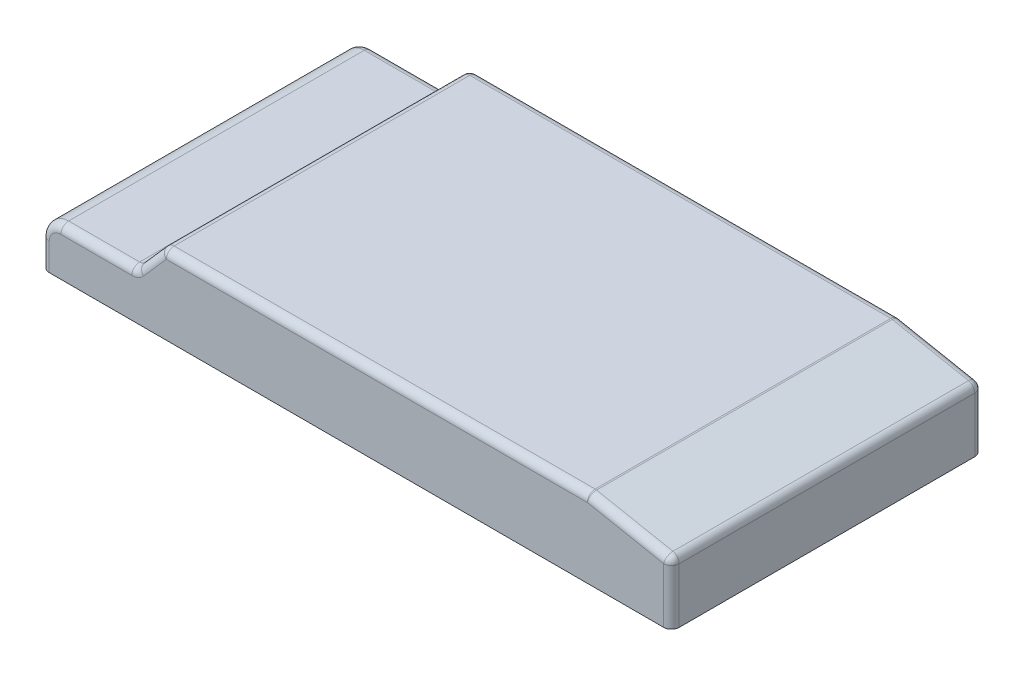
ISO-10303-21;
HEADER;
FILE_DESCRIPTION(('STEP AP214'),'2;1');
FILE_NAME('part.step','',(''),(''),'','','');
FILE_SCHEMA(('AUTOMOTIVE_DESIGN { 1 0 10303 214 1 1 1 1 }'));
ENDSEC;
DATA;
#1=APPLICATION_CONTEXT('core data for automotive mechanical design processes');
#2=APPLICATION_PROTOCOL_DEFINITION('international standard','automotive_design',2000,#1);
#3=PRODUCT_CONTEXT('',#1,'mechanical');
#4=PRODUCT('Part','Part','',(#3));
#5=PRODUCT_RELATED_PRODUCT_CATEGORY('part','',(#4));
#6=PRODUCT_DEFINITION_FORMATION('','',#4);
#7=PRODUCT_DEFINITION_CONTEXT('part definition',#1,'design');
#8=PRODUCT_DEFINITION('design','',#6,#7);
#9=PRODUCT_DEFINITION_SHAPE('','',#8);
#10=(LENGTH_UNIT() NAMED_UNIT(*) SI_UNIT(.MILLI.,.METRE.));
#11=(NAMED_UNIT(*) PLANE_ANGLE_UNIT() SI_UNIT($,.RADIAN.));
#12=(NAMED_UNIT(*) SI_UNIT($,.STERADIAN.) SOLID_ANGLE_UNIT());
#13=UNCERTAINTY_MEASURE_WITH_UNIT(LENGTH_MEASURE(1.E-05),#10,'distance_accuracy_value','');
#14=(GEOMETRIC_REPRESENTATION_CONTEXT(3) GLOBAL_UNCERTAINTY_ASSIGNED_CONTEXT((#13)) GLOBAL_UNIT_ASSIGNED_CONTEXT((#10,
#11,#12)) REPRESENTATION_CONTEXT('',''));
#15=CARTESIAN_POINT('',(0.,0.,0.));
#16=DIRECTION('',(0.,0.,1.));
#17=DIRECTION('',(1.,0.,0.));
#18=AXIS2_PLACEMENT_3D('',#15,#16,#17);
#19=CARTESIAN_POINT('',(0.,-4.59991124991438,101.6));
#20=DIRECTION('',(0.,1.,0.));
#21=DIRECTION('',(0.,0.,1.));
#22=AXIS2_PLACEMENT_3D('',#19,#20,#21);
#23=PLANE('',#22);
#24=DIRECTION('',(0.,0.,-1.));
#25=VECTOR('',#24,1.);
#26=CARTESIAN_POINT('',(-58.1812104530821,-4.59991124991438,101.6));
#27=LINE('',#26,#25);
#28=CARTESIAN_POINT('',(-58.1812104530821,-4.59991124991438,99.06));
#29=VERTEX_POINT('',#28);
#30=CARTESIAN_POINT('',(-58.1812104530821,-4.59991124991438,2.54));
#31=VERTEX_POINT('',#30);
#32=EDGE_CURVE('E526',#29,#31,#27,.T.);
#33=ORIENTED_EDGE('',*,*,#32,.T.);
#34=CARTESIAN_POINT('',(-55.6412104530821,-4.59991124991438,2.54));
#35=DIRECTION('',(0.,1.,0.));
#36=DIRECTION('',(0.,0.,1.));
#37=AXIS2_PLACEMENT_3D('',#34,#35,#36);
#38=CIRCLE('',#37,2.54);
#39=CARTESIAN_POINT('',(-55.6412104530821,-4.59991124991438,0.));
#40=VERTEX_POINT('',#39);
#41=EDGE_CURVE('E589',#31,#40,#38,.F.);
#42=ORIENTED_EDGE('',*,*,#41,.T.);
#43=DIRECTION('',(1.,0.,0.));
#44=VECTOR('',#43,1.);
#45=CARTESIAN_POINT('',(0.,-4.59991124991438,0.));
#46=LINE('',#45,#44);
#47=CARTESIAN_POINT('',(145.018789546918,-4.59991124991438,0.));
#48=VERTEX_POINT('',#47);
#49=EDGE_CURVE('E521',#40,#48,#46,.T.);
#50=ORIENTED_EDGE('',*,*,#49,.T.);
#51=CARTESIAN_POINT('',(145.018789546918,-4.59991124991438,2.54));
#52=DIRECTION('',(0.,1.,0.));
#53=DIRECTION('',(0.,0.,1.));
#54=AXIS2_PLACEMENT_3D('',#51,#52,#53);
#55=CIRCLE('',#54,2.54);
#56=CARTESIAN_POINT('',(147.558789546918,-4.59991124991438,2.54));
#57=VERTEX_POINT('',#56);
#58=EDGE_CURVE('E586',#48,#57,#55,.F.);
#59=ORIENTED_EDGE('',*,*,#58,.T.);
#60=DIRECTION('',(0.,0.,-1.));
#61=VECTOR('',#60,1.);
#62=CARTESIAN_POINT('',(147.558789546918,-4.59991124991438,101.6));
#63=LINE('',#62,#61);
#64=CARTESIAN_POINT('',(147.558789546918,-4.59991124991438,99.06));
#65=VERTEX_POINT('',#64);
#66=EDGE_CURVE('E520',#65,#57,#63,.T.);
#67=ORIENTED_EDGE('',*,*,#66,.F.);
#68=CARTESIAN_POINT('',(145.018789546918,-4.59991124991438,99.06));
#69=DIRECTION('',(0.,1.,0.));
#70=DIRECTION('',(0.,0.,1.));
#71=AXIS2_PLACEMENT_3D('',#68,#69,#70);
#72=CIRCLE('',#71,2.54);
#73=CARTESIAN_POINT('',(145.018789546918,-4.59991124991438,101.6));
#74=VERTEX_POINT('',#73);
#75=EDGE_CURVE('E580',#65,#74,#72,.F.);
#76=ORIENTED_EDGE('',*,*,#75,.T.);
#77=DIRECTION('',(1.,0.,0.));
#78=VECTOR('',#77,1.);
#79=CARTESIAN_POINT('',(0.,-4.59991124991438,101.6));
#80=LINE('',#79,#78);
#81=CARTESIAN_POINT('',(-55.6412104530821,-4.59991124991438,101.6));
#82=VERTEX_POINT('',#81);
#83=EDGE_CURVE('E516',#82,#74,#80,.T.);
#84=ORIENTED_EDGE('',*,*,#83,.F.);
#85=CARTESIAN_POINT('',(-55.6412104530821,-4.59991124991438,99.06));
#86=DIRECTION('',(0.,1.,0.));
#87=DIRECTION('',(0.,0.,1.));
#88=AXIS2_PLACEMENT_3D('',#85,#86,#87);
#89=CIRCLE('',#88,2.54);
#90=EDGE_CURVE('E583',#82,#29,#89,.F.);
#91=ORIENTED_EDGE('',*,*,#90,.T.);
#92=EDGE_LOOP('',(#33,#42,#50,#59,#67,#76,#84,#91));
#93=FACE_BOUND('',#92,.T.);
#94=DIRECTION('',(-1.,0.,0.));
#95=VECTOR('',#94,1.);
#96=CARTESIAN_POINT('',(0.,-4.59991124991438,6.35));
#97=LINE('',#96,#95);
#98=CARTESIAN_POINT('',(119.935660247496,-4.59991124991438,6.34999999999999));
#99=VERTEX_POINT('',#98);
#100=CARTESIAN_POINT('',(-17.1500030519735,-4.59991124991438,6.35));
#101=VERTEX_POINT('',#100);
#102=EDGE_CURVE('E313',#99,#101,#97,.T.);
#103=ORIENTED_EDGE('',*,*,#102,.T.);
#104=DIRECTION('',(0.,0.,-1.));
#105=VECTOR('',#104,1.);
#106=CARTESIAN_POINT('',(-17.1500030519735,-4.59991124991438,0.));
#107=LINE('',#106,#105);
#108=CARTESIAN_POINT('',(-17.1500030519735,-4.59991124991438,95.25));
#109=VERTEX_POINT('',#108);
#110=EDGE_CURVE('E488',#109,#101,#107,.T.);
#111=ORIENTED_EDGE('',*,*,#110,.F.);
#112=DIRECTION('',(1.,0.,0.));
#113=VECTOR('',#112,1.);
#114=CARTESIAN_POINT('',(0.,-4.59991124991438,95.25));
#115=LINE('',#114,#113);
#116=CARTESIAN_POINT('',(119.935660247496,-4.59991124991438,95.25));
#117=VERTEX_POINT('',#116);
#118=EDGE_CURVE('E492',#109,#117,#115,.T.);
#119=ORIENTED_EDGE('',*,*,#118,.T.);
#120=DIRECTION('',(0.,0.,-1.));
#121=VECTOR('',#120,1.);
#122=CARTESIAN_POINT('',(119.935660247496,-4.59991124991438,0.));
#123=LINE('',#122,#121);
#124=EDGE_CURVE('E501',#117,#99,#123,.T.);
#125=ORIENTED_EDGE('',*,*,#124,.T.);
#126=EDGE_LOOP('',(#103,#111,#119,#125));
#127=FACE_BOUND('',#126,.T.);
#128=ADVANCED_FACE('F295',(#93,#127),#23,.F.);
#129=CARTESIAN_POINT('',(0.,0.,0.));
#130=DIRECTION('',(0.,0.,1.));
#131=DIRECTION('',(1.,0.,0.));
#132=AXIS2_PLACEMENT_3D('',#129,#130,#131);
#133=PLANE('',#132);
#134=ORIENTED_EDGE('',*,*,#49,.F.);
#135=DIRECTION('',(0.,-1.,0.));
#136=VECTOR('',#135,1.);
#137=CARTESIAN_POINT('',(-55.6412104530821,0.,0.));
#138=LINE('',#137,#136);
#139=CARTESIAN_POINT('',(-55.6412104530821,4.29008875008562,0.));
#140=VERTEX_POINT('',#139);
#141=EDGE_CURVE('E613',#40,#140,#138,.F.);
#142=ORIENTED_EDGE('',*,*,#141,.T.);
#143=CARTESIAN_POINT('',(-51.8312104530821,4.29008875008562,0.));
#144=DIRECTION('',(0.,0.,1.));
#145=DIRECTION('',(1.,0.,0.));
#146=AXIS2_PLACEMENT_3D('',#143,#144,#145);
#147=CIRCLE('',#146,3.81);
#148=CARTESIAN_POINT('',(-51.8312104530821,8.10008875008561,0.));
#149=VERTEX_POINT('',#148);
#150=EDGE_CURVE('E610',#140,#149,#147,.F.);
#151=ORIENTED_EDGE('',*,*,#150,.T.);
#152=DIRECTION('',(1.,0.,0.));
#153=VECTOR('',#152,1.);
#154=CARTESIAN_POINT('',(-28.6539553864499,8.10008875008561,0.));
#155=LINE('',#154,#153);
#156=CARTESIAN_POINT('',(-28.6539553864499,8.10008875008561,0.));
#157=VERTEX_POINT('',#156);
#158=EDGE_CURVE('E607',#149,#157,#155,.T.);
#159=ORIENTED_EDGE('',*,*,#158,.T.);
#160=CARTESIAN_POINT('',(-28.6539553864499,13.1800887500856,0.));
#161=DIRECTION('',(0.,0.,1.));
#162=DIRECTION('',(1.,0.,0.));
#163=AXIS2_PLACEMENT_3D('',#160,#161,#162);
#164=CIRCLE('',#163,5.08);
#165=CARTESIAN_POINT('',(-24.8474004980594,9.81608222784605,0.));
#166=VERTEX_POINT('',#165);
#167=EDGE_CURVE('E604',#157,#166,#164,.T.);
#168=ORIENTED_EDGE('',*,*,#167,.T.);
#169=DIRECTION('',(0.662206008314876,0.749321828423328,0.));
#170=VECTOR('',#169,1.);
#171=CARTESIAN_POINT('',(-17.3850903915426,18.2600887500856,0.));
#172=LINE('',#171,#170);
#173=CARTESIAN_POINT('',(-17.3850903915426,18.2600887500856,0.));
#174=VERTEX_POINT('',#173);
#175=EDGE_CURVE('E601',#166,#174,#172,.T.);
#176=ORIENTED_EDGE('',*,*,#175,.T.);
#177=DIRECTION('',(1.,0.,0.));
#178=VECTOR('',#177,1.);
#179=CARTESIAN_POINT('',(120.105733974677,18.2600887500856,0.));
#180=LINE('',#179,#178);
#181=CARTESIAN_POINT('',(120.105733974677,18.2600887500856,0.));
#182=VERTEX_POINT('',#181);
#183=EDGE_CURVE('E592',#174,#182,#180,.T.);
#184=ORIENTED_EDGE('',*,*,#183,.T.);
#185=DIRECTION('',(0.981525700668784,-0.191330339796521,0.));
#186=VECTOR('',#185,1.);
#187=CARTESIAN_POINT('',(145.018789546918,13.4037478669496,0.));
#188=LINE('',#187,#186);
#189=CARTESIAN_POINT('',(145.018789546918,13.4037478669496,0.));
#190=VERTEX_POINT('',#189);
#191=EDGE_CURVE('E595',#182,#190,#188,.T.);
#192=ORIENTED_EDGE('',*,*,#191,.T.);
#193=DIRECTION('',(0.,-1.,0.));
#194=VECTOR('',#193,1.);
#195=CARTESIAN_POINT('',(145.018789546918,-4.59991124991438,0.));
#196=LINE('',#195,#194);
#197=EDGE_CURVE('E598',#190,#48,#196,.T.);
#198=ORIENTED_EDGE('',*,*,#197,.T.);
#199=EDGE_LOOP('',(#134,#142,#151,#159,#168,#176,#184,#192,#198));
#200=FACE_BOUND('',#199,.T.);
#201=ADVANCED_FACE('F853',(#200),#133,.F.);
#202=CARTESIAN_POINT('',(8.31189072919763,42.6400453819004,101.6));
#203=DIRECTION('',(0.191330339796521,0.981525700668784,0.));
#204=DIRECTION('',(-0.981525700668784,0.191330339796521,0.));
#205=AXIS2_PLACEMENT_3D('',#202,#203,#204);
#206=PLANE('',#205);
#207=DIRECTION('',(0.,0.,-1.));
#208=VECTOR('',#207,1.);
#209=CARTESIAN_POINT('',(145.504768610001,15.8968231466484,101.6));
#210=LINE('',#209,#208);
#211=CARTESIAN_POINT('',(145.504768610001,15.8968231466484,99.06));
#212=VERTEX_POINT('',#211);
#213=CARTESIAN_POINT('',(145.504768610001,15.8968231466484,2.54));
#214=VERTEX_POINT('',#213);
#215=EDGE_CURVE('E541',#212,#214,#210,.T.);
#216=ORIENTED_EDGE('',*,*,#215,.T.);
#217=DIRECTION('',(0.981525700668784,-0.191330339796521,0.));
#218=VECTOR('',#217,1.);
#219=CARTESIAN_POINT('',(120.59171303776,20.7531640297843,2.54));
#220=LINE('',#219,#218);
#221=CARTESIAN_POINT('',(120.59171303776,20.7531640297843,2.54));
#222=VERTEX_POINT('',#221);
#223=EDGE_CURVE('E661',#214,#222,#220,.F.);
#224=ORIENTED_EDGE('',*,*,#223,.T.);
#225=DIRECTION('',(0.,0.,-1.));
#226=VECTOR('',#225,1.);
#227=CARTESIAN_POINT('',(120.59171303776,20.7531640297843,101.6));
#228=LINE('',#227,#226);
#229=CARTESIAN_POINT('',(120.59171303776,20.7531640297843,99.06));
#230=VERTEX_POINT('',#229);
#231=EDGE_CURVE('E561',#222,#230,#228,.F.);
#232=ORIENTED_EDGE('',*,*,#231,.T.);
#233=DIRECTION('',(0.981525700668784,-0.191330339796521,0.));
#234=VECTOR('',#233,1.);
#235=CARTESIAN_POINT('',(8.31189072919763,42.6400453819004,99.06));
#236=LINE('',#235,#234);
#237=EDGE_CURVE('E658',#230,#212,#236,.T.);
#238=ORIENTED_EDGE('',*,*,#237,.T.);
#239=EDGE_LOOP('',(#216,#224,#232,#238));
#240=FACE_BOUND('',#239,.T.);
#241=ADVANCED_FACE('F801',(#240),#206,.T.);
#242=CARTESIAN_POINT('',(0.,20.8000887500856,101.6));
#243=DIRECTION('',(0.,1.,0.));
#244=DIRECTION('',(0.,0.,1.));
#245=AXIS2_PLACEMENT_3D('',#242,#243,#244);
#246=PLANE('',#245);
#247=DIRECTION('',(0.,0.,-1.));
#248=VECTOR('',#247,1.);
#249=CARTESIAN_POINT('',(120.105733974677,20.8000887500856,101.6));
#250=LINE('',#249,#248);
#251=CARTESIAN_POINT('',(120.105733974677,20.8000887500856,99.06));
#252=VERTEX_POINT('',#251);
#253=CARTESIAN_POINT('',(120.105733974677,20.8000887500856,2.54));
#254=VERTEX_POINT('',#253);
#255=EDGE_CURVE('E553',#252,#254,#250,.T.);
#256=ORIENTED_EDGE('',*,*,#255,.T.);
#257=DIRECTION('',(1.,0.,0.));
#258=VECTOR('',#257,1.);
#259=CARTESIAN_POINT('',(-17.3850903915426,20.8000887500856,2.54));
#260=LINE('',#259,#258);
#261=CARTESIAN_POINT('',(-17.3850903915426,20.8000887500856,2.54));
#262=VERTEX_POINT('',#261);
#263=EDGE_CURVE('E12',#254,#262,#260,.F.);
#264=ORIENTED_EDGE('',*,*,#263,.T.);
#265=DIRECTION('',(0.,0.,-1.));
#266=VECTOR('',#265,1.);
#267=CARTESIAN_POINT('',(-17.3850903915426,20.8000887500856,101.6));
#268=LINE('',#267,#266);
#269=CARTESIAN_POINT('',(-17.3850903915426,20.8000887500856,99.06));
#270=VERTEX_POINT('',#269);
#271=EDGE_CURVE('E557',#262,#270,#268,.F.);
#272=ORIENTED_EDGE('',*,*,#271,.T.);
#273=DIRECTION('',(1.,0.,0.));
#274=VECTOR('',#273,1.);
#275=CARTESIAN_POINT('',(0.,20.8000887500856,99.06));
#276=LINE('',#275,#274);
#277=EDGE_CURVE('E305',#270,#252,#276,.T.);
#278=ORIENTED_EDGE('',*,*,#277,.T.);
#279=EDGE_LOOP('',(#256,#264,#272,#278));
#280=FACE_BOUND('',#279,.T.);
#281=ADVANCED_FACE('F820',(#280),#246,.T.);
#282=CARTESIAN_POINT('',(-20.725468625549,18.3159349272638,101.6));
#283=DIRECTION('',(-0.749321828423328,0.662206008314876,0.));
#284=DIRECTION('',(-0.662206008314876,-0.749321828423328,0.));
#285=AXIS2_PLACEMENT_3D('',#282,#283,#284);
#286=PLANE('',#285);
#287=DIRECTION('',(0.,0.,-1.));
#288=VECTOR('',#287,1.);
#289=CARTESIAN_POINT('',(-19.2883678357379,19.9420920112054,101.6));
#290=LINE('',#289,#288);
#291=CARTESIAN_POINT('',(-19.2883678357379,19.9420920112054,99.06));
#292=VERTEX_POINT('',#291);
#293=CARTESIAN_POINT('',(-19.2883678357379,19.9420920112054,2.54));
#294=VERTEX_POINT('',#293);
#295=EDGE_CURVE('E549',#292,#294,#290,.T.);
#296=ORIENTED_EDGE('',*,*,#295,.T.);
#297=DIRECTION('',(0.662206008314876,0.749321828423328,0.));
#298=VECTOR('',#297,1.);
#299=CARTESIAN_POINT('',(-26.7506779422547,11.4980854889658,2.54));
#300=LINE('',#299,#298);
#301=CARTESIAN_POINT('',(-26.7506779422547,11.4980854889658,2.54));
#302=VERTEX_POINT('',#301);
#303=EDGE_CURVE('E637',#294,#302,#300,.F.);
#304=ORIENTED_EDGE('',*,*,#303,.T.);
#305=DIRECTION('',(0.,0.,-1.));
#306=VECTOR('',#305,1.);
#307=CARTESIAN_POINT('',(-26.7506779422547,11.4980854889658,101.6));
#308=LINE('',#307,#306);
#309=CARTESIAN_POINT('',(-26.7506779422547,11.4980854889658,99.06));
#310=VERTEX_POINT('',#309);
#311=EDGE_CURVE('E569',#302,#310,#308,.F.);
#312=ORIENTED_EDGE('',*,*,#311,.T.);
#313=DIRECTION('',(0.662206008314876,0.749321828423328,0.));
#314=VECTOR('',#313,1.);
#315=CARTESIAN_POINT('',(-20.725468625549,18.3159349272638,99.06));
#316=LINE('',#315,#314);
#317=EDGE_CURVE('E634',#310,#292,#316,.T.);
#318=ORIENTED_EDGE('',*,*,#317,.T.);
#319=EDGE_LOOP('',(#296,#304,#312,#318));
#320=FACE_BOUND('',#319,.T.);
#321=ADVANCED_FACE('F879',(#320),#286,.T.);
#322=CARTESIAN_POINT('',(0.,10.6400887500856,101.6));
#323=DIRECTION('',(0.,1.,0.));
#324=DIRECTION('',(0.,0.,1.));
#325=AXIS2_PLACEMENT_3D('',#322,#323,#324);
#326=PLANE('',#325);
#327=DIRECTION('',(0.,0.,-1.));
#328=VECTOR('',#327,1.);
#329=CARTESIAN_POINT('',(-28.6539553864499,10.6400887500856,0.));
#330=LINE('',#329,#328);
#331=CARTESIAN_POINT('',(-28.6539553864499,10.6400887500856,99.06));
#332=VERTEX_POINT('',#331);
#333=CARTESIAN_POINT('',(-28.6539553864499,10.6400887500856,2.54));
#334=VERTEX_POINT('',#333);
#335=EDGE_CURVE('E565',#332,#334,#330,.T.);
#336=ORIENTED_EDGE('',*,*,#335,.T.);
#337=DIRECTION('',(1.,0.,0.));
#338=VECTOR('',#337,1.);
#339=CARTESIAN_POINT('',(-51.8312104530821,10.6400887500856,2.54));
#340=LINE('',#339,#338);
#341=CARTESIAN_POINT('',(-51.8312104530821,10.6400887500856,2.54));
#342=VERTEX_POINT('',#341);
#343=EDGE_CURVE('E625',#334,#342,#340,.F.);
#344=ORIENTED_EDGE('',*,*,#343,.T.);
#345=DIRECTION('',(0.,0.,-1.));
#346=VECTOR('',#345,1.);
#347=CARTESIAN_POINT('',(-51.8312104530821,10.6400887500856,101.6));
#348=LINE('',#347,#346);
#349=CARTESIAN_POINT('',(-51.8312104530821,10.6400887500856,99.06));
#350=VERTEX_POINT('',#349);
#351=EDGE_CURVE('E537',#342,#350,#348,.F.);
#352=ORIENTED_EDGE('',*,*,#351,.T.);
#353=DIRECTION('',(1.,0.,0.));
#354=VECTOR('',#353,1.);
#355=CARTESIAN_POINT('',(0.,10.6400887500856,99.06));
#356=LINE('',#355,#354);
#357=EDGE_CURVE('E622',#350,#332,#356,.T.);
#358=ORIENTED_EDGE('',*,*,#357,.T.);
#359=EDGE_LOOP('',(#336,#344,#352,#358));
#360=FACE_BOUND('',#359,.T.);
#361=ADVANCED_FACE('F882',(#360),#326,.T.);
#362=CARTESIAN_POINT('',(-58.1812104530821,0.,101.6));
#363=DIRECTION('',(1.,0.,0.));
#364=DIRECTION('',(0.,0.,-1.));
#365=AXIS2_PLACEMENT_3D('',#362,#363,#364);
#366=PLANE('',#365);
#367=DIRECTION('',(0.,0.,-1.));
#368=VECTOR('',#367,1.);
#369=CARTESIAN_POINT('',(-58.1812104530821,4.29008875008562,0.));
#370=LINE('',#369,#368);
#371=CARTESIAN_POINT('',(-58.1812104530821,4.29008875008562,99.06));
#372=VERTEX_POINT('',#371);
#373=CARTESIAN_POINT('',(-58.1812104530821,4.29008875008562,2.54));
#374=VERTEX_POINT('',#373);
#375=EDGE_CURVE('E530',#372,#374,#370,.T.);
#376=ORIENTED_EDGE('',*,*,#375,.T.);
#377=DIRECTION('',(0.,-1.,0.));
#378=VECTOR('',#377,1.);
#379=CARTESIAN_POINT('',(-58.1812104530821,0.,2.54));
#380=LINE('',#379,#378);
#381=EDGE_CURVE('E576',#374,#31,#380,.T.);
#382=ORIENTED_EDGE('',*,*,#381,.T.);
#383=ORIENTED_EDGE('',*,*,#32,.F.);
#384=DIRECTION('',(0.,-1.,0.));
#385=VECTOR('',#384,1.);
#386=CARTESIAN_POINT('',(-58.1812104530821,4.29008875008562,99.06));
#387=LINE('',#386,#385);
#388=EDGE_CURVE('E573',#29,#372,#387,.F.);
#389=ORIENTED_EDGE('',*,*,#388,.T.);
#390=EDGE_LOOP('',(#376,#382,#383,#389));
#391=FACE_BOUND('',#390,.T.);
#392=ADVANCED_FACE('F871',(#391),#366,.F.);
#393=CARTESIAN_POINT('',(147.558789546918,0.,101.6));
#394=DIRECTION('',(1.,0.,0.));
#395=DIRECTION('',(0.,0.,-1.));
#396=AXIS2_PLACEMENT_3D('',#393,#394,#395);
#397=PLANE('',#396);
#398=ORIENTED_EDGE('',*,*,#66,.T.);
#399=DIRECTION('',(0.,-1.,0.));
#400=VECTOR('',#399,1.);
#401=CARTESIAN_POINT('',(147.558789546918,13.4037478669496,2.54));
#402=LINE('',#401,#400);
#403=CARTESIAN_POINT('',(147.558789546918,13.4037478669496,2.54));
#404=VERTEX_POINT('',#403);
#405=EDGE_CURVE('E649',#57,#404,#402,.F.);
#406=ORIENTED_EDGE('',*,*,#405,.T.);
#407=DIRECTION('',(0.,0.,-1.));
#408=VECTOR('',#407,1.);
#409=CARTESIAN_POINT('',(147.558789546918,13.4037478669496,101.6));
#410=LINE('',#409,#408);
#411=CARTESIAN_POINT('',(147.558789546918,13.4037478669496,99.06));
#412=VERTEX_POINT('',#411);
#413=EDGE_CURVE('E545',#404,#412,#410,.F.);
#414=ORIENTED_EDGE('',*,*,#413,.T.);
#415=DIRECTION('',(0.,-1.,0.));
#416=VECTOR('',#415,1.);
#417=CARTESIAN_POINT('',(147.558789546918,0.,99.06));
#418=LINE('',#417,#416);
#419=EDGE_CURVE('E646',#412,#65,#418,.T.);
#420=ORIENTED_EDGE('',*,*,#419,.T.);
#421=EDGE_LOOP('',(#398,#406,#414,#420));
#422=FACE_BOUND('',#421,.T.);
#423=ADVANCED_FACE('F783',(#422),#397,.T.);
#424=CARTESIAN_POINT('',(0.,0.,101.6));
#425=DIRECTION('',(0.,0.,1.));
#426=DIRECTION('',(1.,0.,0.));
#427=AXIS2_PLACEMENT_3D('',#424,#425,#426);
#428=PLANE('',#427);
#429=CARTESIAN_POINT('',(-51.8312104530821,4.29008875008562,101.6));
#430=DIRECTION('',(0.,0.,1.));
#431=DIRECTION('',(1.,0.,0.));
#432=AXIS2_PLACEMENT_3D('',#429,#430,#431);
#433=CIRCLE('',#432,3.81);
#434=CARTESIAN_POINT('',(-51.8312104530821,8.10008875008561,101.6));
#435=VERTEX_POINT('',#434);
#436=CARTESIAN_POINT('',(-55.6412104530821,4.29008875008562,101.6));
#437=VERTEX_POINT('',#436);
#438=EDGE_CURVE('E321',#435,#437,#433,.T.);
#439=ORIENTED_EDGE('',*,*,#438,.T.);
#440=DIRECTION('',(0.,-1.,0.));
#441=VECTOR('',#440,1.);
#442=CARTESIAN_POINT('',(-55.6412104530821,-4.59991124991438,101.6));
#443=LINE('',#442,#441);
#444=EDGE_CURVE('E690',#437,#82,#443,.T.);
#445=ORIENTED_EDGE('',*,*,#444,.T.);
#446=ORIENTED_EDGE('',*,*,#83,.T.);
#447=DIRECTION('',(0.,-1.,0.));
#448=VECTOR('',#447,1.);
#449=CARTESIAN_POINT('',(145.018789546918,0.,101.6));
#450=LINE('',#449,#448);
#451=CARTESIAN_POINT('',(145.018789546918,13.4037478669496,101.6));
#452=VERTEX_POINT('',#451);
#453=EDGE_CURVE('E676',#74,#452,#450,.F.);
#454=ORIENTED_EDGE('',*,*,#453,.T.);
#455=DIRECTION('',(0.981525700668784,-0.191330339796521,0.));
#456=VECTOR('',#455,1.);
#457=CARTESIAN_POINT('',(7.82591166611447,40.1469701022017,101.6));
#458=LINE('',#457,#456);
#459=CARTESIAN_POINT('',(120.105733974677,18.2600887500856,101.6));
#460=VERTEX_POINT('',#459);
#461=EDGE_CURVE('E673',#452,#460,#458,.F.);
#462=ORIENTED_EDGE('',*,*,#461,.T.);
#463=DIRECTION('',(1.,0.,0.));
#464=VECTOR('',#463,1.);
#465=CARTESIAN_POINT('',(0.,18.2600887500856,101.6));
#466=LINE('',#465,#464);
#467=CARTESIAN_POINT('',(-17.3850903915426,18.2600887500856,101.6));
#468=VERTEX_POINT('',#467);
#469=EDGE_CURVE('E670',#460,#468,#466,.F.);
#470=ORIENTED_EDGE('',*,*,#469,.T.);
#471=DIRECTION('',(0.662206008314876,0.749321828423328,0.));
#472=VECTOR('',#471,1.);
#473=CARTESIAN_POINT('',(-18.8221911813538,16.633931666144,101.6));
#474=LINE('',#473,#472);
#475=CARTESIAN_POINT('',(-24.8474004980594,9.81608222784605,101.6));
#476=VERTEX_POINT('',#475);
#477=EDGE_CURVE('E679',#468,#476,#474,.F.);
#478=ORIENTED_EDGE('',*,*,#477,.T.);
#479=CARTESIAN_POINT('',(-28.6539553864499,13.1800887500856,101.6));
#480=DIRECTION('',(0.,0.,1.));
#481=DIRECTION('',(1.,0.,0.));
#482=AXIS2_PLACEMENT_3D('',#479,#480,#481);
#483=CIRCLE('',#482,5.08);
#484=CARTESIAN_POINT('',(-28.6539553864499,8.10008875008561,101.6));
#485=VERTEX_POINT('',#484);
#486=EDGE_CURVE('E682',#476,#485,#483,.F.);
#487=ORIENTED_EDGE('',*,*,#486,.T.);
#488=DIRECTION('',(1.,0.,0.));
#489=VECTOR('',#488,1.);
#490=CARTESIAN_POINT('',(0.,8.10008875008561,101.6));
#491=LINE('',#490,#489);
#492=EDGE_CURVE('E685',#485,#435,#491,.F.);
#493=ORIENTED_EDGE('',*,*,#492,.T.);
#494=EDGE_LOOP('',(#439,#445,#446,#454,#462,#470,#478,#487,#493));
#495=FACE_BOUND('',#494,.T.);
#496=ADVANCED_FACE('F838',(#495),#428,.T.);
#497=CARTESIAN_POINT('',(-51.8312104530821,4.29008875008562,101.6));
#498=DIRECTION('',(0.,0.,1.));
#499=DIRECTION('',(1.,0.,0.));
#500=AXIS2_PLACEMENT_3D('',#497,#498,#499);
#501=CYLINDRICAL_SURFACE('',#500,6.35);
#502=ORIENTED_EDGE('',*,*,#351,.F.);
#503=CARTESIAN_POINT('',(-51.8312104530821,4.29008875008562,2.54));
#504=DIRECTION('',(0.,0.,1.));
#505=DIRECTION('',(1.,0.,0.));
#506=AXIS2_PLACEMENT_3D('',#503,#504,#505);
#507=CIRCLE('',#506,6.35);
#508=EDGE_CURVE('E619',#342,#374,#507,.T.);
#509=ORIENTED_EDGE('',*,*,#508,.T.);
#510=ORIENTED_EDGE('',*,*,#375,.F.);
#511=CARTESIAN_POINT('',(-51.8312104530821,4.29008875008562,99.06));
#512=DIRECTION('',(0.,0.,1.));
#513=DIRECTION('',(1.,0.,0.));
#514=AXIS2_PLACEMENT_3D('',#511,#512,#513);
#515=CIRCLE('',#514,6.35);
#516=EDGE_CURVE('E616',#372,#350,#515,.F.);
#517=ORIENTED_EDGE('',*,*,#516,.T.);
#518=EDGE_LOOP('',(#502,#509,#510,#517));
#519=FACE_BOUND('',#518,.T.);
#520=ADVANCED_FACE('F863',(#519),#501,.T.);
#521=CARTESIAN_POINT('',(145.018789546918,13.4037478669496,101.6));
#522=DIRECTION('',(0.,0.,-1.));
#523=DIRECTION('',(-1.,0.,0.));
#524=AXIS2_PLACEMENT_3D('',#521,#522,#523);
#525=CYLINDRICAL_SURFACE('',#524,2.54);
#526=ORIENTED_EDGE('',*,*,#413,.F.);
#527=CARTESIAN_POINT('',(145.018789546918,13.4037478669496,2.54));
#528=DIRECTION('',(0.,0.,-1.));
#529=DIRECTION('',(-1.,0.,0.));
#530=AXIS2_PLACEMENT_3D('',#527,#528,#529);
#531=CIRCLE('',#530,2.54);
#532=EDGE_CURVE('E655',#404,#214,#531,.F.);
#533=ORIENTED_EDGE('',*,*,#532,.T.);
#534=ORIENTED_EDGE('',*,*,#215,.F.);
#535=CARTESIAN_POINT('',(145.018789546918,13.4037478669496,99.06));
#536=DIRECTION('',(0.,0.,-1.));
#537=DIRECTION('',(-1.,0.,0.));
#538=AXIS2_PLACEMENT_3D('',#535,#536,#537);
#539=CIRCLE('',#538,2.54);
#540=EDGE_CURVE('E652',#212,#412,#539,.T.);
#541=ORIENTED_EDGE('',*,*,#540,.T.);
#542=EDGE_LOOP('',(#526,#533,#534,#541));
#543=FACE_BOUND('',#542,.T.);
#544=ADVANCED_FACE('F797',(#543),#525,.T.);
#545=CARTESIAN_POINT('',(-17.3850903915426,18.2600887500856,101.6));
#546=DIRECTION('',(0.,0.,-1.));
#547=DIRECTION('',(-1.,0.,0.));
#548=AXIS2_PLACEMENT_3D('',#545,#546,#547);
#549=CYLINDRICAL_SURFACE('',#548,2.54);
#550=ORIENTED_EDGE('',*,*,#271,.F.);
#551=CARTESIAN_POINT('',(-17.3850903915426,18.2600887500856,2.54));
#552=DIRECTION('',(0.,0.,-1.));
#553=DIRECTION('',(-1.,0.,0.));
#554=AXIS2_PLACEMENT_3D('',#551,#552,#553);
#555=CIRCLE('',#554,2.54);
#556=EDGE_CURVE('E643',#262,#294,#555,.F.);
#557=ORIENTED_EDGE('',*,*,#556,.T.);
#558=ORIENTED_EDGE('',*,*,#295,.F.);
#559=CARTESIAN_POINT('',(-17.3850903915426,18.2600887500856,99.06));
#560=DIRECTION('',(0.,0.,-1.));
#561=DIRECTION('',(-1.,0.,0.));
#562=AXIS2_PLACEMENT_3D('',#559,#560,#561);
#563=CIRCLE('',#562,2.54);
#564=EDGE_CURVE('E640',#292,#270,#563,.T.);
#565=ORIENTED_EDGE('',*,*,#564,.T.);
#566=EDGE_LOOP('',(#550,#557,#558,#565));
#567=FACE_BOUND('',#566,.T.);
#568=ADVANCED_FACE('F1104',(#567),#549,.T.);
#569=CARTESIAN_POINT('',(120.105733974677,18.2600887500856,101.6));
#570=DIRECTION('',(0.,0.,-1.));
#571=DIRECTION('',(-1.,0.,0.));
#572=AXIS2_PLACEMENT_3D('',#569,#570,#571);
#573=CYLINDRICAL_SURFACE('',#572,2.54);
#574=ORIENTED_EDGE('',*,*,#231,.F.);
#575=CARTESIAN_POINT('',(120.105733974677,18.2600887500856,2.54));
#576=DIRECTION('',(0.,0.,-1.));
#577=DIRECTION('',(-1.,0.,0.));
#578=AXIS2_PLACEMENT_3D('',#575,#576,#577);
#579=CIRCLE('',#578,2.54);
#580=EDGE_CURVE('E667',#222,#254,#579,.F.);
#581=ORIENTED_EDGE('',*,*,#580,.T.);
#582=ORIENTED_EDGE('',*,*,#255,.F.);
#583=CARTESIAN_POINT('',(120.105733974677,18.2600887500856,99.06));
#584=DIRECTION('',(0.,0.,-1.));
#585=DIRECTION('',(-1.,0.,0.));
#586=AXIS2_PLACEMENT_3D('',#583,#584,#585);
#587=CIRCLE('',#586,2.54);
#588=EDGE_CURVE('E664',#252,#230,#587,.T.);
#589=ORIENTED_EDGE('',*,*,#588,.T.);
#590=EDGE_LOOP('',(#574,#581,#582,#589));
#591=FACE_BOUND('',#590,.T.);
#592=ADVANCED_FACE('F817',(#591),#573,.T.);
#593=CARTESIAN_POINT('',(-28.6539553864499,13.1800887500856,101.6));
#594=DIRECTION('',(0.,0.,1.));
#595=DIRECTION('',(1.,0.,0.));
#596=AXIS2_PLACEMENT_3D('',#593,#594,#595);
#597=CYLINDRICAL_SURFACE('',#596,2.54);
#598=ORIENTED_EDGE('',*,*,#311,.F.);
#599=CARTESIAN_POINT('',(-28.6539553864499,13.1800887500856,2.54));
#600=DIRECTION('',(0.,0.,1.));
#601=DIRECTION('',(1.,0.,0.));
#602=AXIS2_PLACEMENT_3D('',#599,#600,#601);
#603=CIRCLE('',#602,2.54);
#604=EDGE_CURVE('E631',#302,#334,#603,.F.);
#605=ORIENTED_EDGE('',*,*,#604,.T.);
#606=ORIENTED_EDGE('',*,*,#335,.F.);
#607=CARTESIAN_POINT('',(-28.6539553864499,13.1800887500856,99.06));
#608=DIRECTION('',(0.,0.,1.));
#609=DIRECTION('',(1.,0.,0.));
#610=AXIS2_PLACEMENT_3D('',#607,#608,#609);
#611=CIRCLE('',#610,2.54);
#612=EDGE_CURVE('E628',#332,#310,#611,.T.);
#613=ORIENTED_EDGE('',*,*,#612,.T.);
#614=EDGE_LOOP('',(#598,#605,#606,#613));
#615=FACE_BOUND('',#614,.T.);
#616=ADVANCED_FACE('F920',(#615),#597,.F.);
#617=CARTESIAN_POINT('',(145.018789546918,0.,2.54));
#618=DIRECTION('',(0.,1.,0.));
#619=DIRECTION('',(0.,0.,1.));
#620=AXIS2_PLACEMENT_3D('',#617,#618,#619);
#621=CYLINDRICAL_SURFACE('',#620,2.54);
#622=CARTESIAN_POINT('',(145.018789546918,13.4037478669496,2.54));
#623=DIRECTION('',(0.,1.,0.));
#624=DIRECTION('',(0.,0.,1.));
#625=AXIS2_PLACEMENT_3D('',#622,#623,#624);
#626=CIRCLE('',#625,2.54);
#627=EDGE_CURVE('E525',#404,#190,#626,.T.);
#628=ORIENTED_EDGE('',*,*,#627,.F.);
#629=ORIENTED_EDGE('',*,*,#405,.F.);
#630=ORIENTED_EDGE('',*,*,#58,.F.);
#631=ORIENTED_EDGE('',*,*,#197,.F.);
#632=EDGE_LOOP('',(#628,#629,#630,#631));
#633=FACE_BOUND('',#632,.T.);
#634=ADVANCED_FACE('F794',(#633),#621,.T.);
#635=CARTESIAN_POINT('',(145.018789546918,13.4037478669496,2.54));
#636=DIRECTION('',(0.,0.,1.));
#637=DIRECTION('',(1.,0.,0.));
#638=AXIS2_PLACEMENT_3D('',#635,#636,#637);
#639=SPHERICAL_SURFACE('',#638,2.54);
#640=ORIENTED_EDGE('',*,*,#532,.F.);
#641=ORIENTED_EDGE('',*,*,#627,.T.);
#642=CARTESIAN_POINT('',(145.018789546918,13.4037478669496,2.54000000000003));
#643=DIRECTION('',(-0.981525700668783,0.191330339796526,0.));
#644=DIRECTION('',(-0.191330339796526,-0.981525700668784,0.));
#645=AXIS2_PLACEMENT_3D('',#642,#643,#644);
#646=CIRCLE('',#645,2.54);
#647=EDGE_CURVE('E727',#214,#190,#646,.T.);
#648=ORIENTED_EDGE('',*,*,#647,.F.);
#649=EDGE_LOOP('',(#640,#641,#648));
#650=FACE_BOUND('',#649,.T.);
#651=ADVANCED_FACE('F805',(#650),#639,.T.);
#652=CARTESIAN_POINT('',(7.82591166611447,40.1469701022017,2.54));
#653=DIRECTION('',(-0.981525700668784,0.191330339796521,0.));
#654=DIRECTION('',(-0.191330339796521,-0.981525700668784,0.));
#655=AXIS2_PLACEMENT_3D('',#652,#653,#654);
#656=CYLINDRICAL_SURFACE('',#655,2.54);
#657=CARTESIAN_POINT('',(120.105733974677,18.2600887500856,2.54));
#658=DIRECTION('',(-0.981525700668784,0.19133033979652,0.));
#659=DIRECTION('',(-0.19133033979652,-0.981525700668785,0.));
#660=AXIS2_PLACEMENT_3D('',#657,#658,#659);
#661=CIRCLE('',#660,2.54);
#662=EDGE_CURVE('E723',#222,#182,#661,.T.);
#663=ORIENTED_EDGE('',*,*,#662,.F.);
#664=ORIENTED_EDGE('',*,*,#223,.F.);
#665=ORIENTED_EDGE('',*,*,#647,.T.);
#666=ORIENTED_EDGE('',*,*,#191,.F.);
#667=EDGE_LOOP('',(#663,#664,#665,#666));
#668=FACE_BOUND('',#667,.T.);
#669=ADVANCED_FACE('F809',(#668),#656,.T.);
#670=CARTESIAN_POINT('',(120.105733974677,18.2600887500856,2.54));
#671=DIRECTION('',(0.,0.,1.));
#672=DIRECTION('',(1.,0.,0.));
#673=AXIS2_PLACEMENT_3D('',#670,#671,#672);
#674=SPHERICAL_SURFACE('',#673,2.54);
#675=ORIENTED_EDGE('',*,*,#580,.F.);
#676=ORIENTED_EDGE('',*,*,#662,.T.);
#677=CARTESIAN_POINT('',(120.105733974677,18.2600887500856,2.54));
#678=DIRECTION('',(-1.,0.,0.));
#679=DIRECTION('',(0.,0.,1.));
#680=AXIS2_PLACEMENT_3D('',#677,#678,#679);
#681=CIRCLE('',#680,2.54);
#682=EDGE_CURVE('E719',#254,#182,#681,.T.);
#683=ORIENTED_EDGE('',*,*,#682,.F.);
#684=EDGE_LOOP('',(#675,#676,#683));
#685=FACE_BOUND('',#684,.T.);
#686=ADVANCED_FACE('F813',(#685),#674,.T.);
#687=CARTESIAN_POINT('',(0.,18.2600887500856,2.54));
#688=DIRECTION('',(-1.,0.,0.));
#689=DIRECTION('',(0.,0.,1.));
#690=AXIS2_PLACEMENT_3D('',#687,#688,#689);
#691=CYLINDRICAL_SURFACE('',#690,2.54);
#692=CARTESIAN_POINT('',(-17.3850903915426,18.2600887500856,2.54));
#693=DIRECTION('',(-1.,0.,0.));
#694=DIRECTION('',(0.,0.,1.));
#695=AXIS2_PLACEMENT_3D('',#692,#693,#694);
#696=CIRCLE('',#695,2.54);
#697=EDGE_CURVE('E715',#262,#174,#696,.T.);
#698=ORIENTED_EDGE('',*,*,#697,.F.);
#699=ORIENTED_EDGE('',*,*,#263,.F.);
#700=ORIENTED_EDGE('',*,*,#682,.T.);
#701=ORIENTED_EDGE('',*,*,#183,.F.);
#702=EDGE_LOOP('',(#698,#699,#700,#701));
#703=FACE_BOUND('',#702,.T.);
#704=ADVANCED_FACE('F907',(#703),#691,.T.);
#705=CARTESIAN_POINT('',(-17.3850903915426,18.2600887500856,2.54));
#706=DIRECTION('',(0.,0.,1.));
#707=DIRECTION('',(1.,0.,0.));
#708=AXIS2_PLACEMENT_3D('',#705,#706,#707);
#709=SPHERICAL_SURFACE('',#708,2.54);
#710=ORIENTED_EDGE('',*,*,#556,.F.);
#711=ORIENTED_EDGE('',*,*,#697,.T.);
#712=CARTESIAN_POINT('',(-17.3850903915426,18.2600887500856,2.54));
#713=DIRECTION('',(-0.662206008314876,-0.749321828423328,0.));
#714=DIRECTION('',(0.749321828423328,-0.662206008314876,0.));
#715=AXIS2_PLACEMENT_3D('',#712,#713,#714);
#716=CIRCLE('',#715,2.54);
#717=EDGE_CURVE('E711',#294,#174,#716,.T.);
#718=ORIENTED_EDGE('',*,*,#717,.F.);
#719=EDGE_LOOP('',(#710,#711,#718));
#720=FACE_BOUND('',#719,.T.);
#721=ADVANCED_FACE('F911',(#720),#709,.T.);
#722=CARTESIAN_POINT('',(-18.8221911813538,16.633931666144,2.54));
#723=DIRECTION('',(-0.662206008314876,-0.749321828423328,0.));
#724=DIRECTION('',(0.749321828423328,-0.662206008314876,0.));
#725=AXIS2_PLACEMENT_3D('',#722,#723,#724);
#726=CYLINDRICAL_SURFACE('',#725,2.54);
#727=ORIENTED_EDGE('',*,*,#717,.T.);
#728=ORIENTED_EDGE('',*,*,#175,.F.);
#729=CARTESIAN_POINT('',(-24.8474004980594,9.81608222784605,2.54));
#730=DIRECTION('',(-0.662206008314876,-0.749321828423327,0.));
#731=DIRECTION('',(0.749321828423327,-0.662206008314876,0.));
#732=AXIS2_PLACEMENT_3D('',#729,#730,#731);
#733=CIRCLE('',#732,2.54);
#734=EDGE_CURVE('E707',#302,#166,#733,.T.);
#735=ORIENTED_EDGE('',*,*,#734,.F.);
#736=ORIENTED_EDGE('',*,*,#303,.F.);
#737=EDGE_LOOP('',(#727,#728,#735,#736));
#738=FACE_BOUND('',#737,.T.);
#739=ADVANCED_FACE('F914',(#738),#726,.T.);
#740=CARTESIAN_POINT('',(-28.6539553864499,13.1800887500856,2.54));
#741=DIRECTION('',(0.,0.,1.));
#742=DIRECTION('',(1.,0.,0.));
#743=AXIS2_PLACEMENT_3D('',#740,#741,#742);
#744=TOROIDAL_SURFACE('',#743,5.08,2.54);
#745=ORIENTED_EDGE('',*,*,#734,.T.);
#746=ORIENTED_EDGE('',*,*,#167,.F.);
#747=CARTESIAN_POINT('',(-28.6539553864499,8.10008875008561,2.54));
#748=DIRECTION('',(-1.,0.,0.));
#749=DIRECTION('',(0.,0.,1.));
#750=AXIS2_PLACEMENT_3D('',#747,#748,#749);
#751=CIRCLE('',#750,2.54);
#752=EDGE_CURVE('E703',#334,#157,#751,.T.);
#753=ORIENTED_EDGE('',*,*,#752,.F.);
#754=ORIENTED_EDGE('',*,*,#604,.F.);
#755=EDGE_LOOP('',(#745,#746,#753,#754));
#756=FACE_BOUND('',#755,.T.);
#757=ADVANCED_FACE('F1187',(#756),#744,.T.);
#758=CARTESIAN_POINT('',(0.,8.10008875008561,2.54));
#759=DIRECTION('',(-1.,0.,0.));
#760=DIRECTION('',(0.,0.,1.));
#761=AXIS2_PLACEMENT_3D('',#758,#759,#760);
#762=CYLINDRICAL_SURFACE('',#761,2.54);
#763=ORIENTED_EDGE('',*,*,#752,.T.);
#764=ORIENTED_EDGE('',*,*,#158,.F.);
#765=CARTESIAN_POINT('',(-51.8312104530821,8.10008875008561,2.54));
#766=DIRECTION('',(-1.,0.,0.));
#767=DIRECTION('',(0.,0.,1.));
#768=AXIS2_PLACEMENT_3D('',#765,#766,#767);
#769=CIRCLE('',#768,2.54);
#770=EDGE_CURVE('E699',#342,#149,#769,.T.);
#771=ORIENTED_EDGE('',*,*,#770,.F.);
#772=ORIENTED_EDGE('',*,*,#343,.F.);
#773=EDGE_LOOP('',(#763,#764,#771,#772));
#774=FACE_BOUND('',#773,.T.);
#775=ADVANCED_FACE('F1196',(#774),#762,.T.);
#776=CARTESIAN_POINT('',(-51.8312104530821,4.29008875008562,2.54));
#777=DIRECTION('',(0.,0.,1.));
#778=DIRECTION('',(1.,0.,0.));
#779=AXIS2_PLACEMENT_3D('',#776,#777,#778);
#780=TOROIDAL_SURFACE('',#779,3.81,2.54);
#781=ORIENTED_EDGE('',*,*,#770,.T.);
#782=ORIENTED_EDGE('',*,*,#150,.F.);
#783=CARTESIAN_POINT('',(-55.6412104530821,4.29008875008562,2.54));
#784=DIRECTION('',(0.,-1.,0.));
#785=DIRECTION('',(0.,0.,-1.));
#786=AXIS2_PLACEMENT_3D('',#783,#784,#785);
#787=CIRCLE('',#786,2.54);
#788=EDGE_CURVE('E695',#374,#140,#787,.T.);
#789=ORIENTED_EDGE('',*,*,#788,.F.);
#790=ORIENTED_EDGE('',*,*,#508,.F.);
#791=EDGE_LOOP('',(#781,#782,#789,#790));
#792=FACE_BOUND('',#791,.T.);
#793=ADVANCED_FACE('F899',(#792),#780,.T.);
#794=CARTESIAN_POINT('',(-55.6412104530821,0.,2.54));
#795=DIRECTION('',(0.,-1.,0.));
#796=DIRECTION('',(0.,0.,-1.));
#797=AXIS2_PLACEMENT_3D('',#794,#795,#796);
#798=CYLINDRICAL_SURFACE('',#797,2.54);
#799=ORIENTED_EDGE('',*,*,#788,.T.);
#800=ORIENTED_EDGE('',*,*,#141,.F.);
#801=ORIENTED_EDGE('',*,*,#41,.F.);
#802=ORIENTED_EDGE('',*,*,#381,.F.);
#803=EDGE_LOOP('',(#799,#800,#801,#802));
#804=FACE_BOUND('',#803,.T.);
#805=ADVANCED_FACE('F902',(#804),#798,.T.);
#806=CARTESIAN_POINT('',(145.018789546918,0.,99.06));
#807=DIRECTION('',(0.,-1.,0.));
#808=DIRECTION('',(0.,0.,-1.));
#809=AXIS2_PLACEMENT_3D('',#806,#807,#808);
#810=CYLINDRICAL_SURFACE('',#809,2.54);
#811=ORIENTED_EDGE('',*,*,#75,.F.);
#812=ORIENTED_EDGE('',*,*,#419,.F.);
#813=CARTESIAN_POINT('',(145.018789546918,13.4037478669496,99.06));
#814=DIRECTION('',(0.,1.,0.));
#815=DIRECTION('',(0.,0.,1.));
#816=AXIS2_PLACEMENT_3D('',#813,#814,#815);
#817=CIRCLE('',#816,2.54);
#818=EDGE_CURVE('E299',#452,#412,#817,.T.);
#819=ORIENTED_EDGE('',*,*,#818,.F.);
#820=ORIENTED_EDGE('',*,*,#453,.F.);
#821=EDGE_LOOP('',(#811,#812,#819,#820));
#822=FACE_BOUND('',#821,.T.);
#823=ADVANCED_FACE('F297',(#822),#810,.T.);
#824=CARTESIAN_POINT('',(145.018789546918,13.4037478669496,99.06));
#825=DIRECTION('',(0.,0.,1.));
#826=DIRECTION('',(1.,0.,0.));
#827=AXIS2_PLACEMENT_3D('',#824,#825,#826);
#828=SPHERICAL_SURFACE('',#827,2.54);
#829=ORIENTED_EDGE('',*,*,#818,.T.);
#830=ORIENTED_EDGE('',*,*,#540,.F.);
#831=CARTESIAN_POINT('',(145.018789546918,13.4037478669496,99.06));
#832=DIRECTION('',(-0.981525700668783,0.191330339796526,0.));
#833=DIRECTION('',(-0.191330339796526,-0.981525700668784,0.));
#834=AXIS2_PLACEMENT_3D('',#831,#832,#833);
#835=CIRCLE('',#834,2.54);
#836=EDGE_CURVE('E764',#452,#212,#835,.T.);
#837=ORIENTED_EDGE('',*,*,#836,.F.);
#838=EDGE_LOOP('',(#829,#830,#837));
#839=FACE_BOUND('',#838,.T.);
#840=ADVANCED_FACE('F776',(#839),#828,.T.);
#841=CARTESIAN_POINT('',(7.82591166611447,40.1469701022017,99.06));
#842=DIRECTION('',(0.981525700668784,-0.191330339796521,0.));
#843=DIRECTION('',(0.191330339796521,0.981525700668784,0.));
#844=AXIS2_PLACEMENT_3D('',#841,#842,#843);
#845=CYLINDRICAL_SURFACE('',#844,2.54);
#846=ORIENTED_EDGE('',*,*,#836,.T.);
#847=ORIENTED_EDGE('',*,*,#237,.F.);
#848=CARTESIAN_POINT('',(120.105733974677,18.2600887500856,99.06));
#849=DIRECTION('',(-0.981525700668785,0.19133033979652,0.));
#850=DIRECTION('',(-0.19133033979652,-0.981525700668785,0.));
#851=AXIS2_PLACEMENT_3D('',#848,#849,#850);
#852=CIRCLE('',#851,2.54);
#853=EDGE_CURVE('E761',#460,#230,#852,.T.);
#854=ORIENTED_EDGE('',*,*,#853,.F.);
#855=ORIENTED_EDGE('',*,*,#461,.F.);
#856=EDGE_LOOP('',(#846,#847,#854,#855));
#857=FACE_BOUND('',#856,.T.);
#858=ADVANCED_FACE('F841',(#857),#845,.T.);
#859=CARTESIAN_POINT('',(120.105733974677,18.2600887500856,99.06));
#860=DIRECTION('',(0.,0.,1.));
#861=DIRECTION('',(1.,0.,0.));
#862=AXIS2_PLACEMENT_3D('',#859,#860,#861);
#863=SPHERICAL_SURFACE('',#862,2.54);
#864=ORIENTED_EDGE('',*,*,#853,.T.);
#865=ORIENTED_EDGE('',*,*,#588,.F.);
#866=CARTESIAN_POINT('',(120.105733974677,18.2600887500856,99.06));
#867=DIRECTION('',(-1.,0.,0.));
#868=DIRECTION('',(0.,0.,1.));
#869=AXIS2_PLACEMENT_3D('',#866,#867,#868);
#870=CIRCLE('',#869,2.54);
#871=EDGE_CURVE('E757',#460,#252,#870,.T.);
#872=ORIENTED_EDGE('',*,*,#871,.F.);
#873=EDGE_LOOP('',(#864,#865,#872));
#874=FACE_BOUND('',#873,.T.);
#875=ADVANCED_FACE('F843',(#874),#863,.T.);
#876=CARTESIAN_POINT('',(0.,18.2600887500856,99.06));
#877=DIRECTION('',(1.,0.,0.));
#878=DIRECTION('',(0.,0.,-1.));
#879=AXIS2_PLACEMENT_3D('',#876,#877,#878);
#880=CYLINDRICAL_SURFACE('',#879,2.54);
#881=ORIENTED_EDGE('',*,*,#871,.T.);
#882=ORIENTED_EDGE('',*,*,#277,.F.);
#883=CARTESIAN_POINT('',(-17.3850903915426,18.2600887500856,99.06));
#884=DIRECTION('',(-1.,0.,0.));
#885=DIRECTION('',(0.,0.,1.));
#886=AXIS2_PLACEMENT_3D('',#883,#884,#885);
#887=CIRCLE('',#886,2.54);
#888=EDGE_CURVE('E753',#468,#270,#887,.T.);
#889=ORIENTED_EDGE('',*,*,#888,.F.);
#890=ORIENTED_EDGE('',*,*,#469,.F.);
#891=EDGE_LOOP('',(#881,#882,#889,#890));
#892=FACE_BOUND('',#891,.T.);
#893=ADVANCED_FACE('F825',(#892),#880,.T.);
#894=CARTESIAN_POINT('',(-17.3850903915426,18.2600887500856,99.06));
#895=DIRECTION('',(0.,0.,1.));
#896=DIRECTION('',(1.,0.,0.));
#897=AXIS2_PLACEMENT_3D('',#894,#895,#896);
#898=SPHERICAL_SURFACE('',#897,2.54);
#899=ORIENTED_EDGE('',*,*,#888,.T.);
#900=ORIENTED_EDGE('',*,*,#564,.F.);
#901=CARTESIAN_POINT('',(-17.3850903915426,18.2600887500856,99.06));
#902=DIRECTION('',(-0.662206008314876,-0.749321828423328,0.));
#903=DIRECTION('',(0.749321828423328,-0.662206008314876,0.));
#904=AXIS2_PLACEMENT_3D('',#901,#902,#903);
#905=CIRCLE('',#904,2.54);
#906=EDGE_CURVE('E749',#468,#292,#905,.T.);
#907=ORIENTED_EDGE('',*,*,#906,.F.);
#908=EDGE_LOOP('',(#899,#900,#907));
#909=FACE_BOUND('',#908,.T.);
#910=ADVANCED_FACE('F831',(#909),#898,.T.);
#911=CARTESIAN_POINT('',(-18.8221911813538,16.633931666144,99.06));
#912=DIRECTION('',(0.662206008314876,0.749321828423328,0.));
#913=DIRECTION('',(-0.749321828423328,0.662206008314876,0.));
#914=AXIS2_PLACEMENT_3D('',#911,#912,#913);
#915=CYLINDRICAL_SURFACE('',#914,2.54);
#916=ORIENTED_EDGE('',*,*,#906,.T.);
#917=ORIENTED_EDGE('',*,*,#317,.F.);
#918=CARTESIAN_POINT('',(-24.8474004980594,9.81608222784605,99.06));
#919=DIRECTION('',(-0.662206008314876,-0.749321828423327,0.));
#920=DIRECTION('',(0.749321828423327,-0.662206008314876,0.));
#921=AXIS2_PLACEMENT_3D('',#918,#919,#920);
#922=CIRCLE('',#921,2.54);
#923=EDGE_CURVE('E745',#476,#310,#922,.T.);
#924=ORIENTED_EDGE('',*,*,#923,.F.);
#925=ORIENTED_EDGE('',*,*,#477,.F.);
#926=EDGE_LOOP('',(#916,#917,#924,#925));
#927=FACE_BOUND('',#926,.T.);
#928=ADVANCED_FACE('F836',(#927),#915,.T.);
#929=CARTESIAN_POINT('',(-28.6539553864499,13.1800887500856,99.06));
#930=DIRECTION('',(0.,0.,1.));
#931=DIRECTION('',(1.,0.,0.));
#932=AXIS2_PLACEMENT_3D('',#929,#930,#931);
#933=TOROIDAL_SURFACE('',#932,5.08,2.54);
#934=ORIENTED_EDGE('',*,*,#923,.T.);
#935=ORIENTED_EDGE('',*,*,#612,.F.);
#936=CARTESIAN_POINT('',(-28.6539553864499,8.10008875008561,99.06));
#937=DIRECTION('',(-1.,0.,0.));
#938=DIRECTION('',(0.,0.,1.));
#939=AXIS2_PLACEMENT_3D('',#936,#937,#938);
#940=CIRCLE('',#939,2.54);
#941=EDGE_CURVE('E741',#485,#332,#940,.T.);
#942=ORIENTED_EDGE('',*,*,#941,.F.);
#943=ORIENTED_EDGE('',*,*,#486,.F.);
#944=EDGE_LOOP('',(#934,#935,#942,#943));
#945=FACE_BOUND('',#944,.T.);
#946=ADVANCED_FACE('F924',(#945),#933,.T.);
#947=CARTESIAN_POINT('',(0.,8.10008875008561,99.06));
#948=DIRECTION('',(1.,0.,0.));
#949=DIRECTION('',(0.,0.,-1.));
#950=AXIS2_PLACEMENT_3D('',#947,#948,#949);
#951=CYLINDRICAL_SURFACE('',#950,2.54);
#952=ORIENTED_EDGE('',*,*,#941,.T.);
#953=ORIENTED_EDGE('',*,*,#357,.F.);
#954=CARTESIAN_POINT('',(-51.8312104530821,8.10008875008561,99.06));
#955=DIRECTION('',(-1.,0.,0.));
#956=DIRECTION('',(0.,0.,1.));
#957=AXIS2_PLACEMENT_3D('',#954,#955,#956);
#958=CIRCLE('',#957,2.54);
#959=EDGE_CURVE('E737',#435,#350,#958,.T.);
#960=ORIENTED_EDGE('',*,*,#959,.F.);
#961=ORIENTED_EDGE('',*,*,#492,.F.);
#962=EDGE_LOOP('',(#952,#953,#960,#961));
#963=FACE_BOUND('',#962,.T.);
#964=ADVANCED_FACE('F928',(#963),#951,.T.);
#965=CARTESIAN_POINT('',(-51.8312104530821,4.29008875008562,99.06));
#966=DIRECTION('',(0.,0.,1.));
#967=DIRECTION('',(1.,0.,0.));
#968=AXIS2_PLACEMENT_3D('',#965,#966,#967);
#969=TOROIDAL_SURFACE('',#968,3.81,2.54);
#970=ORIENTED_EDGE('',*,*,#959,.T.);
#971=ORIENTED_EDGE('',*,*,#516,.F.);
#972=CARTESIAN_POINT('',(-55.6412104530821,4.29008875008562,99.06));
#973=DIRECTION('',(0.,-1.,0.));
#974=DIRECTION('',(0.,0.,-1.));
#975=AXIS2_PLACEMENT_3D('',#972,#973,#974);
#976=CIRCLE('',#975,2.54);
#977=EDGE_CURVE('E510',#437,#372,#976,.T.);
#978=ORIENTED_EDGE('',*,*,#977,.F.);
#979=ORIENTED_EDGE('',*,*,#438,.F.);
#980=EDGE_LOOP('',(#970,#971,#978,#979));
#981=FACE_BOUND('',#980,.T.);
#982=ADVANCED_FACE('F931',(#981),#969,.T.);
#983=CARTESIAN_POINT('',(-55.6412104530821,0.,99.06));
#984=DIRECTION('',(0.,1.,0.));
#985=DIRECTION('',(0.,0.,1.));
#986=AXIS2_PLACEMENT_3D('',#983,#984,#985);
#987=CYLINDRICAL_SURFACE('',#986,2.54);
#988=ORIENTED_EDGE('',*,*,#977,.T.);
#989=ORIENTED_EDGE('',*,*,#388,.F.);
#990=ORIENTED_EDGE('',*,*,#90,.F.);
#991=ORIENTED_EDGE('',*,*,#444,.F.);
#992=EDGE_LOOP('',(#988,#989,#990,#991));
#993=FACE_BOUND('',#992,.T.);
#994=ADVANCED_FACE('F934',(#993),#987,.T.);
#995=CARTESIAN_POINT('',(0.,15.7200887500856,6.35));
#996=DIRECTION('',(0.,0.,1.));
#997=DIRECTION('',(1.,0.,0.));
#998=AXIS2_PLACEMENT_3D('',#995,#996,#997);
#999=PLANE('',#998);
#1000=ORIENTED_EDGE('',*,*,#102,.F.);
#1001=DIRECTION('',(0.,-1.,0.));
#1002=VECTOR('',#1001,1.);
#1003=CARTESIAN_POINT('',(119.935660247496,15.7200887500856,6.35));
#1004=LINE('',#1003,#1002);
#1005=CARTESIAN_POINT('',(119.935660247496,15.7200887500856,6.35));
#1006=VERTEX_POINT('',#1005);
#1007=EDGE_CURVE('E469',#1006,#99,#1004,.T.);
#1008=ORIENTED_EDGE('',*,*,#1007,.F.);
#1009=DIRECTION('',(-1.,0.,0.));
#1010=VECTOR('',#1009,1.);
#1011=CARTESIAN_POINT('',(0.,15.7200887500856,6.35));
#1012=LINE('',#1011,#1010);
#1013=CARTESIAN_POINT('',(-17.1500030519735,15.7200887500856,6.35));
#1014=VERTEX_POINT('',#1013);
#1015=EDGE_CURVE('E477',#1006,#1014,#1012,.T.);
#1016=ORIENTED_EDGE('',*,*,#1015,.T.);
#1017=DIRECTION('',(0.,-1.,0.));
#1018=VECTOR('',#1017,1.);
#1019=CARTESIAN_POINT('',(-17.1500030519735,15.7200887500856,6.35));
#1020=LINE('',#1019,#1018);
#1021=EDGE_CURVE('E507',#1014,#101,#1020,.T.);
#1022=ORIENTED_EDGE('',*,*,#1021,.T.);
#1023=EDGE_LOOP('',(#1000,#1008,#1016,#1022));
#1024=FACE_BOUND('',#1023,.T.);
#1025=ADVANCED_FACE('F479',(#1024),#999,.T.);
#1026=CARTESIAN_POINT('',(-17.1500030519735,15.7200887500856,0.));
#1027=DIRECTION('',(-1.,0.,0.));
#1028=DIRECTION('',(0.,0.,1.));
#1029=AXIS2_PLACEMENT_3D('',#1026,#1027,#1028);
#1030=PLANE('',#1029);
#1031=ORIENTED_EDGE('',*,*,#110,.T.);
#1032=ORIENTED_EDGE('',*,*,#1021,.F.);
#1033=DIRECTION('',(0.,0.,-1.));
#1034=VECTOR('',#1033,1.);
#1035=CARTESIAN_POINT('',(-17.1500030519735,15.7200887500856,0.));
#1036=LINE('',#1035,#1034);
#1037=CARTESIAN_POINT('',(-17.1500030519735,15.7200887500856,95.25));
#1038=VERTEX_POINT('',#1037);
#1039=EDGE_CURVE('E482',#1038,#1014,#1036,.T.);
#1040=ORIENTED_EDGE('',*,*,#1039,.F.);
#1041=DIRECTION('',(0.,-1.,0.));
#1042=VECTOR('',#1041,1.);
#1043=CARTESIAN_POINT('',(-17.1500030519735,15.7200887500856,95.25));
#1044=LINE('',#1043,#1042);
#1045=EDGE_CURVE('E511',#1038,#109,#1044,.T.);
#1046=ORIENTED_EDGE('',*,*,#1045,.T.);
#1047=EDGE_LOOP('',(#1031,#1032,#1040,#1046));
#1048=FACE_BOUND('',#1047,.T.);
#1049=ADVANCED_FACE('F941',(#1048),#1030,.F.);
#1050=CARTESIAN_POINT('',(0.,15.7200887500856,95.25));
#1051=DIRECTION('',(0.,0.,-1.));
#1052=DIRECTION('',(-1.,0.,0.));
#1053=AXIS2_PLACEMENT_3D('',#1050,#1051,#1052);
#1054=PLANE('',#1053);
#1055=ORIENTED_EDGE('',*,*,#118,.F.);
#1056=ORIENTED_EDGE('',*,*,#1045,.F.);
#1057=DIRECTION('',(1.,0.,0.));
#1058=VECTOR('',#1057,1.);
#1059=CARTESIAN_POINT('',(0.,15.7200887500856,95.25));
#1060=LINE('',#1059,#1058);
#1061=CARTESIAN_POINT('',(119.935660247496,15.7200887500856,95.25));
#1062=VERTEX_POINT('',#1061);
#1063=EDGE_CURVE('E476',#1038,#1062,#1060,.T.);
#1064=ORIENTED_EDGE('',*,*,#1063,.T.);
#1065=DIRECTION('',(0.,-1.,0.));
#1066=VECTOR('',#1065,1.);
#1067=CARTESIAN_POINT('',(119.935660247496,15.7200887500856,95.25));
#1068=LINE('',#1067,#1066);
#1069=EDGE_CURVE('E471',#1062,#117,#1068,.T.);
#1070=ORIENTED_EDGE('',*,*,#1069,.T.);
#1071=EDGE_LOOP('',(#1055,#1056,#1064,#1070));
#1072=FACE_BOUND('',#1071,.T.);
#1073=ADVANCED_FACE('F1001',(#1072),#1054,.T.);
#1074=CARTESIAN_POINT('',(119.935660247496,15.7200887500856,0.));
#1075=DIRECTION('',(-1.,0.,0.));
#1076=DIRECTION('',(0.,0.,1.));
#1077=AXIS2_PLACEMENT_3D('',#1074,#1075,#1076);
#1078=PLANE('',#1077);
#1079=ORIENTED_EDGE('',*,*,#124,.F.);
#1080=ORIENTED_EDGE('',*,*,#1069,.F.);
#1081=DIRECTION('',(0.,0.,-1.));
#1082=VECTOR('',#1081,1.);
#1083=CARTESIAN_POINT('',(119.935660247496,15.7200887500856,0.));
#1084=LINE('',#1083,#1082);
#1085=EDGE_CURVE('E466',#1062,#1006,#1084,.T.);
#1086=ORIENTED_EDGE('',*,*,#1085,.T.);
#1087=ORIENTED_EDGE('',*,*,#1007,.T.);
#1088=EDGE_LOOP('',(#1079,#1080,#1086,#1087));
#1089=FACE_BOUND('',#1088,.T.);
#1090=ADVANCED_FACE('F468',(#1089),#1078,.T.);
#1091=CARTESIAN_POINT('',(0.,15.7200887500856,0.));
#1092=DIRECTION('',(0.,-1.,0.));
#1093=DIRECTION('',(0.,0.,-1.));
#1094=AXIS2_PLACEMENT_3D('',#1091,#1092,#1093);
#1095=PLANE('',#1094);
#1096=ORIENTED_EDGE('',*,*,#1015,.F.);
#1097=ORIENTED_EDGE('',*,*,#1085,.F.);
#1098=ORIENTED_EDGE('',*,*,#1063,.F.);
#1099=ORIENTED_EDGE('',*,*,#1039,.T.);
#1100=EDGE_LOOP('',(#1096,#1097,#1098,#1099));
#1101=FACE_BOUND('',#1100,.T.);
#1102=ADVANCED_FACE('F485',(#1101),#1095,.T.);
#1103=CLOSED_SHELL('',(#128,#201,#241,#281,#321,#361,#392,#423,#496,#520,#544,#568,#592,#616,
#634,#651,#669,#686,#704,#721,#739,#757,#775,#793,#805,#823,#840,#858,#875,#893,#910,#928,#946,
#964,#982,#994,#1025,#1049,#1073,#1090,#1102));
#1104=MANIFOLD_SOLID_BREP('B2',#1103);
#1105=ADVANCED_BREP_SHAPE_REPRESENTATION('',(#18,#1104),#14);
#1106=SHAPE_DEFINITION_REPRESENTATION(#9,#1105);
ENDSEC;
END-ISO-10303-21;
